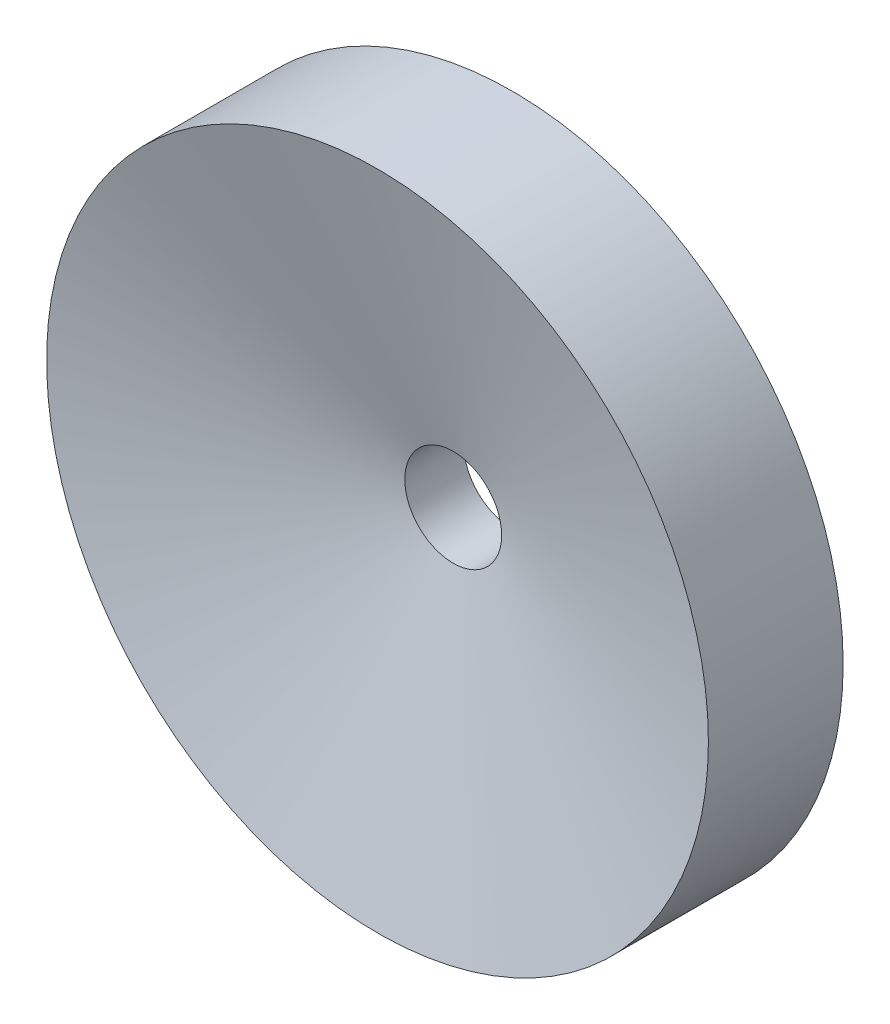
ISO-10303-21;
HEADER;
FILE_DESCRIPTION(('STEP AP214'),'2;1');
FILE_NAME('part.step','',(''),(''),'','','');
FILE_SCHEMA(('AUTOMOTIVE_DESIGN { 1 0 10303 214 1 1 1 1 }'));
ENDSEC;
DATA;
#1=APPLICATION_CONTEXT('core data for automotive mechanical design processes');
#2=APPLICATION_PROTOCOL_DEFINITION('international standard','automotive_design',2000,#1);
#3=PRODUCT_CONTEXT('',#1,'mechanical');
#4=PRODUCT('Part','Part','',(#3));
#5=PRODUCT_RELATED_PRODUCT_CATEGORY('part','',(#4));
#6=PRODUCT_DEFINITION_FORMATION('','',#4);
#7=PRODUCT_DEFINITION_CONTEXT('part definition',#1,'design');
#8=PRODUCT_DEFINITION('design','',#6,#7);
#9=PRODUCT_DEFINITION_SHAPE('','',#8);
#10=(LENGTH_UNIT() NAMED_UNIT(*) SI_UNIT(.MILLI.,.METRE.));
#11=(NAMED_UNIT(*) PLANE_ANGLE_UNIT() SI_UNIT($,.RADIAN.));
#12=(NAMED_UNIT(*) SI_UNIT($,.STERADIAN.) SOLID_ANGLE_UNIT());
#13=UNCERTAINTY_MEASURE_WITH_UNIT(LENGTH_MEASURE(1.E-05),#10,'distance_accuracy_value','');
#14=(GEOMETRIC_REPRESENTATION_CONTEXT(3) GLOBAL_UNCERTAINTY_ASSIGNED_CONTEXT((#13)) GLOBAL_UNIT_ASSIGNED_CONTEXT((#10,
#11,#12)) REPRESENTATION_CONTEXT('',''));
#15=CARTESIAN_POINT('',(0.,0.,0.));
#16=DIRECTION('',(0.,0.,1.));
#17=DIRECTION('',(1.,0.,0.));
#18=AXIS2_PLACEMENT_3D('',#15,#16,#17);
#19=CARTESIAN_POINT('',(0.,0.,2.5));
#20=DIRECTION('',(0.,0.,-1.));
#21=DIRECTION('',(-1.,0.,0.));
#22=AXIS2_PLACEMENT_3D('',#19,#20,#21);
#23=CYLINDRICAL_SURFACE('',#22,14.);
#24=CARTESIAN_POINT('',(0.,0.,0.));
#25=DIRECTION('',(0.,0.,1.));
#26=DIRECTION('',(1.,0.,0.));
#27=AXIS2_PLACEMENT_3D('',#24,#25,#26);
#28=CIRCLE('',#27,14.);
#29=CARTESIAN_POINT('',(14.,0.,0.));
#30=VERTEX_POINT('',#29);
#31=EDGE_CURVE('E50',#30,#30,#28,.T.);
#32=ORIENTED_EDGE('',*,*,#31,.T.);
#33=EDGE_LOOP('',(#32));
#34=FACE_BOUND('',#33,.T.);
#35=CARTESIAN_POINT('',(0.,0.,5.70199284955183));
#36=DIRECTION('',(0.,0.,1.));
#37=DIRECTION('',(1.,0.,0.));
#38=AXIS2_PLACEMENT_3D('',#35,#36,#37);
#39=CIRCLE('',#38,14.);
#40=CARTESIAN_POINT('',(14.,0.,5.70199284955183));
#41=VERTEX_POINT('',#40);
#42=EDGE_CURVE('E65',#41,#41,#39,.T.);
#43=ORIENTED_EDGE('',*,*,#42,.F.);
#44=EDGE_LOOP('',(#43));
#45=FACE_BOUND('',#44,.T.);
#46=ADVANCED_FACE('F31',(#34,#45),#23,.T.);
#47=CARTESIAN_POINT('',(0.,0.,0.));
#48=DIRECTION('',(0.,0.,1.));
#49=DIRECTION('',(1.,0.,0.));
#50=AXIS2_PLACEMENT_3D('',#47,#48,#49);
#51=PLANE('',#50);
#52=CARTESIAN_POINT('',(0.,0.,0.));
#53=DIRECTION('',(0.,0.,1.));
#54=DIRECTION('',(1.,0.,0.));
#55=AXIS2_PLACEMENT_3D('',#52,#53,#54);
#56=CIRCLE('',#55,2.05);
#57=CARTESIAN_POINT('',(2.05,0.,0.));
#58=VERTEX_POINT('',#57);
#59=EDGE_CURVE('E34',#58,#58,#56,.T.);
#60=ORIENTED_EDGE('',*,*,#59,.T.);
#61=EDGE_LOOP('',(#60));
#62=FACE_BOUND('',#61,.T.);
#63=CARTESIAN_POINT('',(-9.50000000000001,0.,0.));
#64=DIRECTION('',(0.,0.,1.));
#65=DIRECTION('',(1.,0.,0.));
#66=AXIS2_PLACEMENT_3D('',#63,#64,#65);
#67=CIRCLE('',#66,1.45);
#68=CARTESIAN_POINT('',(-8.05000000000001,0.,0.));
#69=VERTEX_POINT('',#68);
#70=EDGE_CURVE('E10',#69,#69,#67,.F.);
#71=ORIENTED_EDGE('',*,*,#70,.F.);
#72=EDGE_LOOP('',(#71));
#73=FACE_BOUND('',#72,.T.);
#74=CARTESIAN_POINT('',(0.,-7.99999999999999,0.));
#75=DIRECTION('',(0.,0.,1.));
#76=DIRECTION('',(1.,0.,0.));
#77=AXIS2_PLACEMENT_3D('',#74,#75,#76);
#78=CIRCLE('',#77,1.45);
#79=CARTESIAN_POINT('',(1.44999999999999,-7.99999999999999,0.));
#80=VERTEX_POINT('',#79);
#81=EDGE_CURVE('E38',#80,#80,#78,.F.);
#82=ORIENTED_EDGE('',*,*,#81,.F.);
#83=EDGE_LOOP('',(#82));
#84=FACE_BOUND('',#83,.T.);
#85=CARTESIAN_POINT('',(0.,8.00000000000001,0.));
#86=DIRECTION('',(0.,0.,1.));
#87=DIRECTION('',(1.,0.,0.));
#88=AXIS2_PLACEMENT_3D('',#85,#86,#87);
#89=CIRCLE('',#88,1.45);
#90=CARTESIAN_POINT('',(1.45,8.00000000000001,0.));
#91=VERTEX_POINT('',#90);
#92=EDGE_CURVE('E42',#91,#91,#89,.F.);
#93=ORIENTED_EDGE('',*,*,#92,.F.);
#94=EDGE_LOOP('',(#93));
#95=FACE_BOUND('',#94,.T.);
#96=CARTESIAN_POINT('',(9.49999999999999,0.,0.));
#97=DIRECTION('',(0.,0.,1.));
#98=DIRECTION('',(1.,0.,0.));
#99=AXIS2_PLACEMENT_3D('',#96,#97,#98);
#100=CIRCLE('',#99,1.45);
#101=CARTESIAN_POINT('',(10.95,0.,0.));
#102=VERTEX_POINT('',#101);
#103=EDGE_CURVE('E47',#102,#102,#100,.F.);
#104=ORIENTED_EDGE('',*,*,#103,.F.);
#105=EDGE_LOOP('',(#104));
#106=FACE_BOUND('',#105,.T.);
#107=ORIENTED_EDGE('',*,*,#31,.F.);
#108=EDGE_LOOP('',(#107));
#109=FACE_BOUND('',#108,.T.);
#110=ADVANCED_FACE('F82',(#62,#73,#84,#95,#106,#109),#51,.F.);
#111=CARTESIAN_POINT('',(9.49999999999999,0.,-1.5));
#112=DIRECTION('',(0.,0.,1.));
#113=DIRECTION('',(1.,0.,0.));
#114=AXIS2_PLACEMENT_3D('',#111,#112,#113);
#115=CYLINDRICAL_SURFACE('',#114,1.45);
#116=CARTESIAN_POINT('',(9.49999999999999,0.,-1.5));
#117=DIRECTION('',(0.,0.,-1.));
#118=DIRECTION('',(-1.,0.,0.));
#119=AXIS2_PLACEMENT_3D('',#116,#117,#118);
#120=CIRCLE('',#119,1.45);
#121=CARTESIAN_POINT('',(8.05,0.,-1.5));
#122=VERTEX_POINT('',#121);
#123=EDGE_CURVE('E53',#122,#122,#120,.T.);
#124=ORIENTED_EDGE('',*,*,#123,.F.);
#125=EDGE_LOOP('',(#124));
#126=FACE_BOUND('',#125,.T.);
#127=ORIENTED_EDGE('',*,*,#103,.T.);
#128=EDGE_LOOP('',(#127));
#129=FACE_BOUND('',#128,.T.);
#130=ADVANCED_FACE('F87',(#126,#129),#115,.T.);
#131=CARTESIAN_POINT('',(9.49999999999999,0.,-1.5));
#132=DIRECTION('',(0.,0.,-1.));
#133=DIRECTION('',(-1.,0.,0.));
#134=AXIS2_PLACEMENT_3D('',#131,#132,#133);
#135=PLANE('',#134);
#136=ORIENTED_EDGE('',*,*,#123,.T.);
#137=EDGE_LOOP('',(#136));
#138=FACE_BOUND('',#137,.T.);
#139=ADVANCED_FACE('F94',(#138),#135,.T.);
#140=CARTESIAN_POINT('',(0.,8.00000000000001,-1.5));
#141=DIRECTION('',(0.,0.,1.));
#142=DIRECTION('',(1.,0.,0.));
#143=AXIS2_PLACEMENT_3D('',#140,#141,#142);
#144=CYLINDRICAL_SURFACE('',#143,1.45);
#145=CARTESIAN_POINT('',(0.,8.00000000000001,-1.5));
#146=DIRECTION('',(0.,0.,-1.));
#147=DIRECTION('',(-1.,0.,0.));
#148=AXIS2_PLACEMENT_3D('',#145,#146,#147);
#149=CIRCLE('',#148,1.45);
#150=CARTESIAN_POINT('',(-1.45,8.00000000000001,-1.5));
#151=VERTEX_POINT('',#150);
#152=EDGE_CURVE('E56',#151,#151,#149,.T.);
#153=ORIENTED_EDGE('',*,*,#152,.F.);
#154=EDGE_LOOP('',(#153));
#155=FACE_BOUND('',#154,.T.);
#156=ORIENTED_EDGE('',*,*,#92,.T.);
#157=EDGE_LOOP('',(#156));
#158=FACE_BOUND('',#157,.T.);
#159=ADVANCED_FACE('F102',(#155,#158),#144,.T.);
#160=CARTESIAN_POINT('',(0.,8.00000000000001,-1.5));
#161=DIRECTION('',(0.,0.,-1.));
#162=DIRECTION('',(-1.,0.,0.));
#163=AXIS2_PLACEMENT_3D('',#160,#161,#162);
#164=PLANE('',#163);
#165=ORIENTED_EDGE('',*,*,#152,.T.);
#166=EDGE_LOOP('',(#165));
#167=FACE_BOUND('',#166,.T.);
#168=ADVANCED_FACE('F106',(#167),#164,.T.);
#169=CARTESIAN_POINT('',(0.,-7.99999999999999,-1.5));
#170=DIRECTION('',(0.,0.,1.));
#171=DIRECTION('',(1.,0.,0.));
#172=AXIS2_PLACEMENT_3D('',#169,#170,#171);
#173=CYLINDRICAL_SURFACE('',#172,1.45);
#174=CARTESIAN_POINT('',(0.,-7.99999999999999,-1.5));
#175=DIRECTION('',(0.,0.,-1.));
#176=DIRECTION('',(1.,0.,0.));
#177=AXIS2_PLACEMENT_3D('',#174,#175,#176);
#178=CIRCLE('',#177,1.45);
#179=CARTESIAN_POINT('',(1.44999999999999,-7.99999999999999,-1.5));
#180=VERTEX_POINT('',#179);
#181=EDGE_CURVE('E59',#180,#180,#178,.T.);
#182=ORIENTED_EDGE('',*,*,#181,.F.);
#183=EDGE_LOOP('',(#182));
#184=FACE_BOUND('',#183,.T.);
#185=ORIENTED_EDGE('',*,*,#81,.T.);
#186=EDGE_LOOP('',(#185));
#187=FACE_BOUND('',#186,.T.);
#188=ADVANCED_FACE('F110',(#184,#187),#173,.T.);
#189=CARTESIAN_POINT('',(0.,-7.99999999999999,-1.5));
#190=DIRECTION('',(0.,0.,1.));
#191=DIRECTION('',(1.,0.,0.));
#192=AXIS2_PLACEMENT_3D('',#189,#190,#191);
#193=PLANE('',#192);
#194=ORIENTED_EDGE('',*,*,#181,.T.);
#195=EDGE_LOOP('',(#194));
#196=FACE_BOUND('',#195,.T.);
#197=ADVANCED_FACE('F114',(#196),#193,.F.);
#198=CARTESIAN_POINT('',(-9.50000000000001,0.,-1.5));
#199=DIRECTION('',(0.,0.,1.));
#200=DIRECTION('',(1.,0.,0.));
#201=AXIS2_PLACEMENT_3D('',#198,#199,#200);
#202=CYLINDRICAL_SURFACE('',#201,1.45);
#203=CARTESIAN_POINT('',(-9.50000000000001,0.,-1.5));
#204=DIRECTION('',(0.,0.,-1.));
#205=DIRECTION('',(1.,0.,0.));
#206=AXIS2_PLACEMENT_3D('',#203,#204,#205);
#207=CIRCLE('',#206,1.45);
#208=CARTESIAN_POINT('',(-8.05000000000001,0.,-1.5));
#209=VERTEX_POINT('',#208);
#210=EDGE_CURVE('E62',#209,#209,#207,.T.);
#211=ORIENTED_EDGE('',*,*,#210,.F.);
#212=EDGE_LOOP('',(#211));
#213=FACE_BOUND('',#212,.T.);
#214=ORIENTED_EDGE('',*,*,#70,.T.);
#215=EDGE_LOOP('',(#214));
#216=FACE_BOUND('',#215,.T.);
#217=ADVANCED_FACE('F118',(#213,#216),#202,.T.);
#218=CARTESIAN_POINT('',(-9.50000000000001,0.,-1.5));
#219=DIRECTION('',(0.,0.,1.));
#220=DIRECTION('',(1.,0.,0.));
#221=AXIS2_PLACEMENT_3D('',#218,#219,#220);
#222=PLANE('',#221);
#223=ORIENTED_EDGE('',*,*,#210,.T.);
#224=EDGE_LOOP('',(#223));
#225=FACE_BOUND('',#224,.T.);
#226=ADVANCED_FACE('F122',(#225),#222,.F.);
#227=CARTESIAN_POINT('',(0.,0.,-1.5));
#228=DIRECTION('',(0.,0.,1.));
#229=DIRECTION('',(1.,0.,0.));
#230=AXIS2_PLACEMENT_3D('',#227,#228,#229);
#231=CYLINDRICAL_SURFACE('',#230,2.05);
#232=CARTESIAN_POINT('',(0.,0.,2.5));
#233=DIRECTION('',(0.,0.,1.));
#234=DIRECTION('',(1.,0.,0.));
#235=AXIS2_PLACEMENT_3D('',#232,#233,#234);
#236=CIRCLE('',#235,2.05);
#237=CARTESIAN_POINT('',(2.05,0.,2.5));
#238=VERTEX_POINT('',#237);
#239=EDGE_CURVE('E68',#238,#238,#236,.T.);
#240=ORIENTED_EDGE('',*,*,#239,.T.);
#241=EDGE_LOOP('',(#240));
#242=FACE_BOUND('',#241,.T.);
#243=ORIENTED_EDGE('',*,*,#59,.F.);
#244=EDGE_LOOP('',(#243));
#245=FACE_BOUND('',#244,.T.);
#246=ADVANCED_FACE('F72',(#242,#245),#231,.F.);
#247=CARTESIAN_POINT('',(0.,0.,5.70199284955183));
#248=DIRECTION('',(0.,0.,1.));
#249=DIRECTION('',(1.,0.,0.));
#250=AXIS2_PLACEMENT_3D('',#247,#248,#249);
#251=CONICAL_SURFACE('',#250,14.,1.30899693899575);
#252=CARTESIAN_POINT('',(2.05,0.,2.5));
#253=CARTESIAN_POINT('',(2.17447916666666,0.,2.53335409218283));
#254=CARTESIAN_POINT('',(2.29895833333333,0.,2.56670818436566));
#255=CARTESIAN_POINT('',(2.54791666666666,0.,2.63341636873133));
#256=CARTESIAN_POINT('',(2.67239583333333,0.,2.66677046091416));
#257=CARTESIAN_POINT('',(2.92135416666666,0.,2.73347864527982));
#258=CARTESIAN_POINT('',(3.04583333333333,0.,2.76683273746265));
#259=CARTESIAN_POINT('',(3.29479166666666,0.,2.83354092182832));
#260=CARTESIAN_POINT('',(3.41927083333333,0.,2.86689501401115));
#261=CARTESIAN_POINT('',(3.66822916666666,0.,2.93360319837681));
#262=CARTESIAN_POINT('',(3.79270833333333,0.,2.96695729055964));
#263=CARTESIAN_POINT('',(4.04166666666666,0.,3.03366547492531));
#264=CARTESIAN_POINT('',(4.16614583333333,0.,3.06701956710814));
#265=CARTESIAN_POINT('',(4.41510416666666,0.,3.1337277514738));
#266=CARTESIAN_POINT('',(4.53958333333333,0.,3.16708184365663));
#267=CARTESIAN_POINT('',(4.78854166666666,0.,3.2337900280223));
#268=CARTESIAN_POINT('',(4.91302083333333,0.,3.26714412020513));
#269=CARTESIAN_POINT('',(5.16197916666666,0.,3.33385230457079));
#270=CARTESIAN_POINT('',(5.28645833333333,0.,3.36720639675362));
#271=CARTESIAN_POINT('',(5.53541666666666,0.,3.43391458111929));
#272=CARTESIAN_POINT('',(5.65989583333333,0.,3.46726867330212));
#273=CARTESIAN_POINT('',(5.90885416666666,0.,3.53397685766778));
#274=CARTESIAN_POINT('',(6.03333333333333,0.,3.56733094985061));
#275=CARTESIAN_POINT('',(6.28229166666666,0.,3.63403913421627));
#276=CARTESIAN_POINT('',(6.40677083333333,0.,3.66739322639911));
#277=CARTESIAN_POINT('',(6.65572916666666,0.,3.73410141076477));
#278=CARTESIAN_POINT('',(6.78020833333333,0.,3.7674555029476));
#279=CARTESIAN_POINT('',(7.02916666666666,0.,3.83416368731326));
#280=CARTESIAN_POINT('',(7.15364583333333,0.,3.8675177794961));
#281=CARTESIAN_POINT('',(7.40260416666666,0.,3.93422596386176));
#282=CARTESIAN_POINT('',(7.52708333333333,0.,3.96758005604459));
#283=CARTESIAN_POINT('',(7.77604166666666,0.,4.03428824041025));
#284=CARTESIAN_POINT('',(7.90052083333333,0.,4.06764233259309));
#285=CARTESIAN_POINT('',(8.14947916666666,0.,4.13435051695875));
#286=CARTESIAN_POINT('',(8.27395833333333,0.,4.16770460914158));
#287=CARTESIAN_POINT('',(8.52291666666666,0.,4.23441279350724));
#288=CARTESIAN_POINT('',(8.64739583333333,0.,4.26776688569008));
#289=CARTESIAN_POINT('',(8.89635416666666,0.,4.33447507005574));
#290=CARTESIAN_POINT('',(9.02083333333333,0.,4.36782916223857));
#291=CARTESIAN_POINT('',(9.26979166666666,0.,4.43453734660423));
#292=CARTESIAN_POINT('',(9.39427083333333,0.,4.46789143878706));
#293=CARTESIAN_POINT('',(9.64322916666666,0.,4.53459962315273));
#294=CARTESIAN_POINT('',(9.76770833333333,0.,4.56795371533556));
#295=CARTESIAN_POINT('',(10.0166666666667,0.,4.63466189970122));
#296=CARTESIAN_POINT('',(10.1411458333333,0.,4.66801599188405));
#297=CARTESIAN_POINT('',(10.3901041666667,0.,4.73472417624972));
#298=CARTESIAN_POINT('',(10.5145833333333,0.,4.76807826843255));
#299=CARTESIAN_POINT('',(10.7635416666667,0.,4.83478645279821));
#300=CARTESIAN_POINT('',(10.8880208333333,0.,4.86814054498104));
#301=CARTESIAN_POINT('',(11.1369791666667,0.,4.93484872934671));
#302=CARTESIAN_POINT('',(11.2614583333333,0.,4.96820282152954));
#303=CARTESIAN_POINT('',(11.5104166666667,0.,5.0349110058952));
#304=CARTESIAN_POINT('',(11.6348958333333,0.,5.06826509807803));
#305=CARTESIAN_POINT('',(11.8838541666667,0.,5.1349732824437));
#306=CARTESIAN_POINT('',(12.0083333333333,0.,5.16832737462653));
#307=CARTESIAN_POINT('',(12.2572916666667,0.,5.23503555899219));
#308=CARTESIAN_POINT('',(12.3817708333333,0.,5.26838965117502));
#309=CARTESIAN_POINT('',(12.6307291666667,0.,5.33509783554069));
#310=CARTESIAN_POINT('',(12.7552083333333,0.,5.36845192772352));
#311=CARTESIAN_POINT('',(13.0041666666667,0.,5.43516011208918));
#312=CARTESIAN_POINT('',(13.1286458333333,0.,5.46851420427201));
#313=CARTESIAN_POINT('',(13.3776041666667,0.,5.53522238863768));
#314=CARTESIAN_POINT('',(13.5020833333333,0.,5.56857648082051));
#315=CARTESIAN_POINT('',(13.7510416666667,0.,5.63528466518617));
#316=CARTESIAN_POINT('',(13.8755208333333,0.,5.668638757369));
#317=CARTESIAN_POINT('',(14.,0.,5.70199284955183));
#318=B_SPLINE_CURVE_WITH_KNOTS('',3,(#252,#253,#254,#255,#256,#257,#258,#259,#260,#261,#262,
#263,#264,#265,#266,#267,#268,#269,#270,#271,#272,#273,#274,#275,#276,#277,#278,#279,#280,#281,
#282,#283,#284,#285,#286,#287,#288,#289,#290,#291,#292,#293,#294,#295,#296,#297,#298,#299,#300,
#301,#302,#303,#304,#305,#306,#307,#308,#309,#310,#311,#312,#313,#314,#315,#316,#317),
.UNSPECIFIED.,.F.,.F.,(4,2,2,2,2,2,2,2,2,2,2,2,2,2,2,2,2,2,2,2,2,2,2,2,2,2,2,2,2,2,2,2,4),(0.,
0.386610948621888,0.773221897243779,1.15983284586567,1.54644379448756,1.93305474310945,
2.31966569173134,2.70627664035323,3.09288758897512,3.47949853759701,3.8661094862189,
4.25272043484079,4.63933138346268,5.02594233208457,5.41255328070646,5.79916422932834,
6.18577517795024,6.57238612657213,6.95899707519401,7.34560802381591,7.73221897243779,
8.11882992105969,8.50544086968157,8.89205181830346,9.27866276692535,9.66527371554724,
10.0518846641691,10.438495612791,10.8251065614129,11.2117175100348,11.5983284586567,
11.9849394072786,12.3715503559005),.UNSPECIFIED.);
#319=EDGE_CURVE('BSEAM75',#238,#41,#318,.T.);
#320=ORIENTED_EDGE('',*,*,#239,.F.);
#321=ORIENTED_EDGE('',*,*,#42,.T.);
#322=ORIENTED_EDGE('',*,*,#319,.T.);
#323=ORIENTED_EDGE('',*,*,#319,.F.);
#324=EDGE_LOOP('',(#320,#322,#321,#323));
#325=FACE_BOUND('',#324,.T.);
#326=ADVANCED_FACE('F75',(#325),#251,.F.);
#327=CLOSED_SHELL('',(#46,#110,#130,#139,#159,#168,#188,#197,#217,#226,#246,#326));
#328=MANIFOLD_SOLID_BREP('B2',#327);
#329=ADVANCED_BREP_SHAPE_REPRESENTATION('',(#18,#328),#14);
#330=SHAPE_DEFINITION_REPRESENTATION(#9,#329);
ENDSEC;
END-ISO-10303-21;
